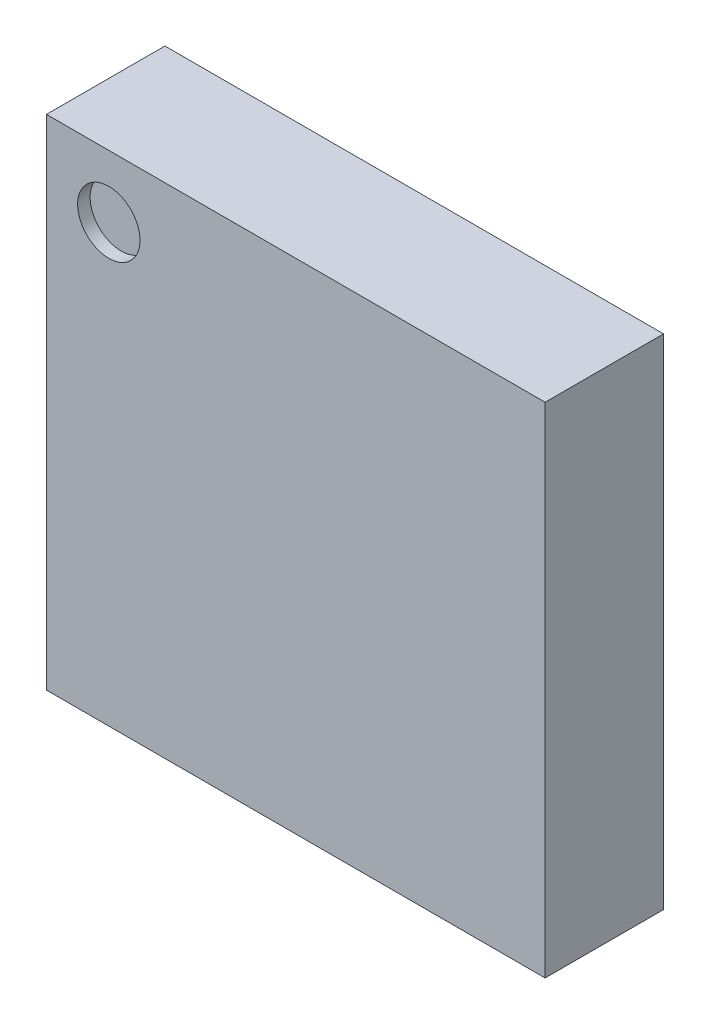
ISO-10303-21;
HEADER;
FILE_DESCRIPTION(('STEP AP214'),'2;1');
FILE_NAME('part.step','',(''),(''),'','','');
FILE_SCHEMA(('AUTOMOTIVE_DESIGN { 1 0 10303 214 1 1 1 1 }'));
ENDSEC;
DATA;
#1=APPLICATION_CONTEXT('core data for automotive mechanical design processes');
#2=APPLICATION_PROTOCOL_DEFINITION('international standard','automotive_design',2000,#1);
#3=PRODUCT_CONTEXT('',#1,'mechanical');
#4=PRODUCT('Part','Part','',(#3));
#5=PRODUCT_RELATED_PRODUCT_CATEGORY('part','',(#4));
#6=PRODUCT_DEFINITION_FORMATION('','',#4);
#7=PRODUCT_DEFINITION_CONTEXT('part definition',#1,'design');
#8=PRODUCT_DEFINITION('design','',#6,#7);
#9=PRODUCT_DEFINITION_SHAPE('','',#8);
#10=(LENGTH_UNIT() NAMED_UNIT(*) SI_UNIT(.MILLI.,.METRE.));
#11=(NAMED_UNIT(*) PLANE_ANGLE_UNIT() SI_UNIT($,.RADIAN.));
#12=(NAMED_UNIT(*) SI_UNIT($,.STERADIAN.) SOLID_ANGLE_UNIT());
#13=UNCERTAINTY_MEASURE_WITH_UNIT(LENGTH_MEASURE(1.E-05),#10,'distance_accuracy_value','');
#14=(GEOMETRIC_REPRESENTATION_CONTEXT(3) GLOBAL_UNCERTAINTY_ASSIGNED_CONTEXT((#13)) GLOBAL_UNIT_ASSIGNED_CONTEXT((#10,
#11,#12)) REPRESENTATION_CONTEXT('',''));
#15=CARTESIAN_POINT('',(0.,0.,0.));
#16=DIRECTION('',(0.,0.,1.));
#17=DIRECTION('',(1.,0.,0.));
#18=AXIS2_PLACEMENT_3D('',#15,#16,#17);
#19=CARTESIAN_POINT('',(-2.,-2.,0.05));
#20=DIRECTION('',(1.,0.,0.));
#21=DIRECTION('',(0.,0.,1.));
#22=AXIS2_PLACEMENT_3D('',#19,#20,#21);
#23=PLANE('',#22);
#24=DIRECTION('',(0.,1.,0.));
#25=VECTOR('',#24,1.);
#26=CARTESIAN_POINT('',(-2.,-2.,1.));
#27=LINE('',#26,#25);
#28=CARTESIAN_POINT('',(-2.,-2.,1.));
#29=VERTEX_POINT('',#28);
#30=CARTESIAN_POINT('',(-2.,2.,1.));
#31=VERTEX_POINT('',#30);
#32=EDGE_CURVE('E11',#29,#31,#27,.T.);
#33=ORIENTED_EDGE('',*,*,#32,.T.);
#34=DIRECTION('',(0.,0.,1.));
#35=VECTOR('',#34,1.);
#36=CARTESIAN_POINT('',(-2.,2.,0.05));
#37=LINE('',#36,#35);
#38=CARTESIAN_POINT('',(-2.,2.,0.05));
#39=VERTEX_POINT('',#38);
#40=EDGE_CURVE('E24',#39,#31,#37,.T.);
#41=ORIENTED_EDGE('',*,*,#40,.F.);
#42=DIRECTION('',(0.,1.,0.));
#43=VECTOR('',#42,1.);
#44=CARTESIAN_POINT('',(-2.,-2.,0.05));
#45=LINE('',#44,#43);
#46=CARTESIAN_POINT('',(-2.,-2.,0.05));
#47=VERTEX_POINT('',#46);
#48=EDGE_CURVE('E95',#47,#39,#45,.T.);
#49=ORIENTED_EDGE('',*,*,#48,.F.);
#50=DIRECTION('',(0.,0.,1.));
#51=VECTOR('',#50,1.);
#52=CARTESIAN_POINT('',(-2.,-2.,0.05));
#53=LINE('',#52,#51);
#54=EDGE_CURVE('E36',#47,#29,#53,.T.);
#55=ORIENTED_EDGE('',*,*,#54,.T.);
#56=EDGE_LOOP('',(#33,#41,#49,#55));
#57=FACE_BOUND('',#56,.T.);
#58=ADVANCED_FACE('F17',(#57),#23,.F.);
#59=CARTESIAN_POINT('',(-2.,-2.,0.05));
#60=DIRECTION('',(0.,1.,0.));
#61=DIRECTION('',(0.,0.,1.));
#62=AXIS2_PLACEMENT_3D('',#59,#60,#61);
#63=PLANE('',#62);
#64=DIRECTION('',(0.,0.,1.));
#65=VECTOR('',#64,1.);
#66=CARTESIAN_POINT('',(2.,-2.,0.05));
#67=LINE('',#66,#65);
#68=CARTESIAN_POINT('',(2.,-2.,0.05));
#69=VERTEX_POINT('',#68);
#70=CARTESIAN_POINT('',(2.,-2.,1.));
#71=VERTEX_POINT('',#70);
#72=EDGE_CURVE('E91',#69,#71,#67,.T.);
#73=ORIENTED_EDGE('',*,*,#72,.T.);
#74=DIRECTION('',(1.,0.,0.));
#75=VECTOR('',#74,1.);
#76=CARTESIAN_POINT('',(-2.,-2.,1.));
#77=LINE('',#76,#75);
#78=EDGE_CURVE('E89',#29,#71,#77,.T.);
#79=ORIENTED_EDGE('',*,*,#78,.F.);
#80=ORIENTED_EDGE('',*,*,#54,.F.);
#81=DIRECTION('',(1.,0.,0.));
#82=VECTOR('',#81,1.);
#83=CARTESIAN_POINT('',(-2.,-2.,0.05));
#84=LINE('',#83,#82);
#85=EDGE_CURVE('E87',#47,#69,#84,.T.);
#86=ORIENTED_EDGE('',*,*,#85,.T.);
#87=EDGE_LOOP('',(#73,#79,#80,#86));
#88=FACE_BOUND('',#87,.T.);
#89=ADVANCED_FACE('F109',(#88),#63,.F.);
#90=CARTESIAN_POINT('',(-2.,-2.,1.));
#91=DIRECTION('',(0.,0.,1.));
#92=DIRECTION('',(1.,0.,0.));
#93=AXIS2_PLACEMENT_3D('',#90,#91,#92);
#94=PLANE('',#93);
#95=ORIENTED_EDGE('',*,*,#32,.F.);
#96=ORIENTED_EDGE('',*,*,#78,.T.);
#97=DIRECTION('',(0.,1.,0.));
#98=VECTOR('',#97,1.);
#99=CARTESIAN_POINT('',(2.,-2.,1.));
#100=LINE('',#99,#98);
#101=CARTESIAN_POINT('',(2.,2.,1.));
#102=VERTEX_POINT('',#101);
#103=EDGE_CURVE('E85',#71,#102,#100,.T.);
#104=ORIENTED_EDGE('',*,*,#103,.T.);
#105=DIRECTION('',(1.,0.,0.));
#106=VECTOR('',#105,1.);
#107=CARTESIAN_POINT('',(-2.,2.,1.));
#108=LINE('',#107,#106);
#109=EDGE_CURVE('E83',#31,#102,#108,.T.);
#110=ORIENTED_EDGE('',*,*,#109,.F.);
#111=EDGE_LOOP('',(#95,#96,#104,#110));
#112=FACE_BOUND('',#111,.T.);
#113=CARTESIAN_POINT('',(-1.5,1.5,1.));
#114=DIRECTION('',(0.,0.,1.));
#115=DIRECTION('',(1.,0.,0.));
#116=AXIS2_PLACEMENT_3D('',#113,#114,#115);
#117=CIRCLE('',#116,0.25);
#118=CARTESIAN_POINT('',(-1.25,1.5,1.));
#119=VERTEX_POINT('',#118);
#120=EDGE_CURVE('E68',#119,#119,#117,.T.);
#121=ORIENTED_EDGE('',*,*,#120,.F.);
#122=EDGE_LOOP('',(#121));
#123=FACE_BOUND('',#122,.T.);
#124=ADVANCED_FACE('F111',(#112,#123),#94,.T.);
#125=CARTESIAN_POINT('',(-2.,2.,0.05));
#126=DIRECTION('',(0.,1.,0.));
#127=DIRECTION('',(0.,0.,1.));
#128=AXIS2_PLACEMENT_3D('',#125,#126,#127);
#129=PLANE('',#128);
#130=DIRECTION('',(1.,0.,0.));
#131=VECTOR('',#130,1.);
#132=CARTESIAN_POINT('',(-2.,2.,0.05));
#133=LINE('',#132,#131);
#134=CARTESIAN_POINT('',(2.,2.,0.05));
#135=VERTEX_POINT('',#134);
#136=EDGE_CURVE('E80',#39,#135,#133,.T.);
#137=ORIENTED_EDGE('',*,*,#136,.F.);
#138=ORIENTED_EDGE('',*,*,#40,.T.);
#139=ORIENTED_EDGE('',*,*,#109,.T.);
#140=DIRECTION('',(0.,0.,1.));
#141=VECTOR('',#140,1.);
#142=CARTESIAN_POINT('',(2.,2.,0.05));
#143=LINE('',#142,#141);
#144=EDGE_CURVE('E75',#135,#102,#143,.T.);
#145=ORIENTED_EDGE('',*,*,#144,.F.);
#146=EDGE_LOOP('',(#137,#138,#139,#145));
#147=FACE_BOUND('',#146,.T.);
#148=ADVANCED_FACE('F102',(#147),#129,.T.);
#149=CARTESIAN_POINT('',(-2.,-2.,0.05));
#150=DIRECTION('',(0.,0.,1.));
#151=DIRECTION('',(1.,0.,0.));
#152=AXIS2_PLACEMENT_3D('',#149,#150,#151);
#153=PLANE('',#152);
#154=ORIENTED_EDGE('',*,*,#136,.T.);
#155=DIRECTION('',(0.,1.,0.));
#156=VECTOR('',#155,1.);
#157=CARTESIAN_POINT('',(2.,-2.,0.05));
#158=LINE('',#157,#156);
#159=EDGE_CURVE('E72',#69,#135,#158,.T.);
#160=ORIENTED_EDGE('',*,*,#159,.F.);
#161=ORIENTED_EDGE('',*,*,#85,.F.);
#162=ORIENTED_EDGE('',*,*,#48,.T.);
#163=EDGE_LOOP('',(#154,#160,#161,#162));
#164=FACE_BOUND('',#163,.T.);
#165=ADVANCED_FACE('F98',(#164),#153,.F.);
#166=CARTESIAN_POINT('',(2.,-2.,0.05));
#167=DIRECTION('',(1.,0.,0.));
#168=DIRECTION('',(0.,0.,1.));
#169=AXIS2_PLACEMENT_3D('',#166,#167,#168);
#170=PLANE('',#169);
#171=ORIENTED_EDGE('',*,*,#72,.F.);
#172=ORIENTED_EDGE('',*,*,#159,.T.);
#173=ORIENTED_EDGE('',*,*,#144,.T.);
#174=ORIENTED_EDGE('',*,*,#103,.F.);
#175=EDGE_LOOP('',(#171,#172,#173,#174));
#176=FACE_BOUND('',#175,.T.);
#177=ADVANCED_FACE('F106',(#176),#170,.T.);
#178=CARTESIAN_POINT('',(-1.5,1.5,0.9));
#179=DIRECTION('',(0.,0.,1.));
#180=DIRECTION('',(1.,0.,0.));
#181=AXIS2_PLACEMENT_3D('',#178,#179,#180);
#182=CYLINDRICAL_SURFACE('',#181,0.25);
#183=CARTESIAN_POINT('',(-1.5,1.5,0.9));
#184=DIRECTION('',(0.,0.,1.));
#185=DIRECTION('',(1.,0.,0.));
#186=AXIS2_PLACEMENT_3D('',#183,#184,#185);
#187=CIRCLE('',#186,0.25);
#188=CARTESIAN_POINT('',(-1.25,1.5,0.9));
#189=VERTEX_POINT('',#188);
#190=EDGE_CURVE('E66',#189,#189,#187,.T.);
#191=ORIENTED_EDGE('',*,*,#190,.F.);
#192=DIRECTION('',(0.,0.,1.));
#193=VECTOR('',#192,1.);
#194=CARTESIAN_POINT('',(-1.25,1.5,0.9));
#195=LINE('',#194,#193);
#196=EDGE_CURVE('E63',#189,#119,#195,.T.);
#197=ORIENTED_EDGE('',*,*,#196,.T.);
#198=ORIENTED_EDGE('',*,*,#120,.T.);
#199=ORIENTED_EDGE('',*,*,#196,.F.);
#200=EDGE_LOOP('',(#191,#197,#198,#199));
#201=FACE_BOUND('',#200,.T.);
#202=ADVANCED_FACE('F65',(#201),#182,.F.);
#203=CARTESIAN_POINT('',(-1.5,1.5,0.9));
#204=DIRECTION('',(0.,0.,1.));
#205=DIRECTION('',(1.,0.,0.));
#206=AXIS2_PLACEMENT_3D('',#203,#204,#205);
#207=PLANE('',#206);
#208=ORIENTED_EDGE('',*,*,#190,.T.);
#209=EDGE_LOOP('',(#208));
#210=FACE_BOUND('',#209,.T.);
#211=ADVANCED_FACE('F71',(#210),#207,.T.);
#212=CLOSED_SHELL('',(#58,#89,#124,#148,#165,#177,#202,#211));
#213=MANIFOLD_SOLID_BREP('B1',#212);
#214=ADVANCED_BREP_SHAPE_REPRESENTATION('',(#18,#213),#14);
#215=SHAPE_DEFINITION_REPRESENTATION(#9,#214);
ENDSEC;
END-ISO-10303-21;
